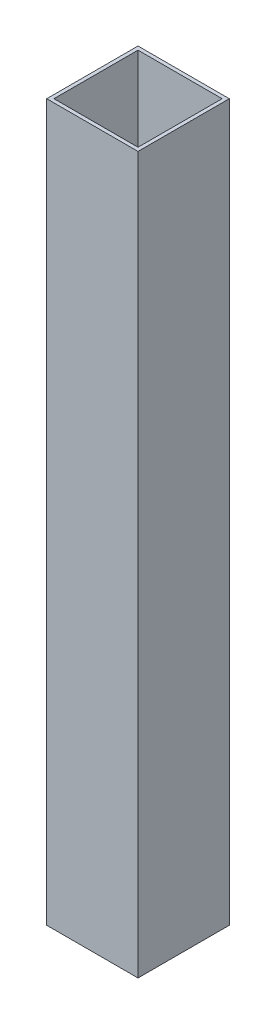
ISO-10303-21;
HEADER;
FILE_DESCRIPTION(('STEP AP214'),'2;1');
FILE_NAME('part.step','',(''),(''),'','','');
FILE_SCHEMA(('AUTOMOTIVE_DESIGN { 1 0 10303 214 1 1 1 1 }'));
ENDSEC;
DATA;
#1=APPLICATION_CONTEXT('core data for automotive mechanical design processes');
#2=APPLICATION_PROTOCOL_DEFINITION('international standard','automotive_design',2000,#1);
#3=PRODUCT_CONTEXT('',#1,'mechanical');
#4=PRODUCT('Part','Part','',(#3));
#5=PRODUCT_RELATED_PRODUCT_CATEGORY('part','',(#4));
#6=PRODUCT_DEFINITION_FORMATION('','',#4);
#7=PRODUCT_DEFINITION_CONTEXT('part definition',#1,'design');
#8=PRODUCT_DEFINITION('design','',#6,#7);
#9=PRODUCT_DEFINITION_SHAPE('','',#8);
#10=(LENGTH_UNIT() NAMED_UNIT(*) SI_UNIT(.MILLI.,.METRE.));
#11=(NAMED_UNIT(*) PLANE_ANGLE_UNIT() SI_UNIT($,.RADIAN.));
#12=(NAMED_UNIT(*) SI_UNIT($,.STERADIAN.) SOLID_ANGLE_UNIT());
#13=UNCERTAINTY_MEASURE_WITH_UNIT(LENGTH_MEASURE(1.E-05),#10,'distance_accuracy_value','');
#14=(GEOMETRIC_REPRESENTATION_CONTEXT(3) GLOBAL_UNCERTAINTY_ASSIGNED_CONTEXT((#13)) GLOBAL_UNIT_ASSIGNED_CONTEXT((#10,
#11,#12)) REPRESENTATION_CONTEXT('',''));
#15=CARTESIAN_POINT('',(0.,0.,0.));
#16=DIRECTION('',(0.,0.,1.));
#17=DIRECTION('',(1.,0.,0.));
#18=AXIS2_PLACEMENT_3D('',#15,#16,#17);
#19=CARTESIAN_POINT('',(0.,199.2,0.));
#20=DIRECTION('',(0.,1.,0.));
#21=DIRECTION('',(0.,0.,1.));
#22=AXIS2_PLACEMENT_3D('',#19,#20,#21);
#23=PLANE('',#22);
#24=DIRECTION('',(0.,0.,1.));
#25=VECTOR('',#24,1.);
#26=CARTESIAN_POINT('',(0.,199.2,0.));
#27=LINE('',#26,#25);
#28=CARTESIAN_POINT('',(0.,199.2,0.));
#29=VERTEX_POINT('',#28);
#30=CARTESIAN_POINT('',(0.,199.2,25.4));
#31=VERTEX_POINT('',#30);
#32=EDGE_CURVE('E140',#29,#31,#27,.T.);
#33=ORIENTED_EDGE('',*,*,#32,.T.);
#34=DIRECTION('',(1.,0.,0.));
#35=VECTOR('',#34,1.);
#36=CARTESIAN_POINT('',(0.,199.2,25.4));
#37=LINE('',#36,#35);
#38=CARTESIAN_POINT('',(25.4,199.2,25.4));
#39=VERTEX_POINT('',#38);
#40=EDGE_CURVE('E143',#31,#39,#37,.T.);
#41=ORIENTED_EDGE('',*,*,#40,.T.);
#42=DIRECTION('',(0.,0.,-1.));
#43=VECTOR('',#42,1.);
#44=CARTESIAN_POINT('',(25.4,199.2,0.));
#45=LINE('',#44,#43);
#46=CARTESIAN_POINT('',(25.4,199.2,0.));
#47=VERTEX_POINT('',#46);
#48=EDGE_CURVE('E146',#39,#47,#45,.T.);
#49=ORIENTED_EDGE('',*,*,#48,.T.);
#50=DIRECTION('',(-1.,0.,0.));
#51=VECTOR('',#50,1.);
#52=CARTESIAN_POINT('',(0.,199.2,0.));
#53=LINE('',#52,#51);
#54=EDGE_CURVE('E148',#47,#29,#53,.T.);
#55=ORIENTED_EDGE('',*,*,#54,.T.);
#56=EDGE_LOOP('',(#33,#41,#49,#55));
#57=FACE_BOUND('',#56,.T.);
#58=DIRECTION('',(1.,0.,0.));
#59=VECTOR('',#58,1.);
#60=CARTESIAN_POINT('',(1.,199.2,24.4));
#61=LINE('',#60,#59);
#62=CARTESIAN_POINT('',(1.,199.2,24.4));
#63=VERTEX_POINT('',#62);
#64=CARTESIAN_POINT('',(24.4,199.2,24.4));
#65=VERTEX_POINT('',#64);
#66=EDGE_CURVE('E112',#63,#65,#61,.T.);
#67=ORIENTED_EDGE('',*,*,#66,.F.);
#68=DIRECTION('',(0.,0.,1.));
#69=VECTOR('',#68,1.);
#70=CARTESIAN_POINT('',(1.,199.2,1.));
#71=LINE('',#70,#69);
#72=CARTESIAN_POINT('',(1.,199.2,1.));
#73=VERTEX_POINT('',#72);
#74=EDGE_CURVE('E104',#73,#63,#71,.T.);
#75=ORIENTED_EDGE('',*,*,#74,.F.);
#76=DIRECTION('',(-1.,0.,0.));
#77=VECTOR('',#76,1.);
#78=CARTESIAN_POINT('',(1.,199.2,1.));
#79=LINE('',#78,#77);
#80=CARTESIAN_POINT('',(24.4,199.2,1.));
#81=VERTEX_POINT('',#80);
#82=EDGE_CURVE('E126',#81,#73,#79,.T.);
#83=ORIENTED_EDGE('',*,*,#82,.F.);
#84=DIRECTION('',(0.,0.,-1.));
#85=VECTOR('',#84,1.);
#86=CARTESIAN_POINT('',(24.4,199.2,1.));
#87=LINE('',#86,#85);
#88=EDGE_CURVE('E124',#65,#81,#87,.T.);
#89=ORIENTED_EDGE('',*,*,#88,.F.);
#90=EDGE_LOOP('',(#67,#75,#83,#89));
#91=FACE_BOUND('',#90,.T.);
#92=ADVANCED_FACE('F39',(#57,#91),#23,.T.);
#93=CARTESIAN_POINT('',(0.,0.,0.));
#94=DIRECTION('',(0.,1.,0.));
#95=DIRECTION('',(0.,0.,1.));
#96=AXIS2_PLACEMENT_3D('',#93,#94,#95);
#97=PLANE('',#96);
#98=DIRECTION('',(0.,0.,1.));
#99=VECTOR('',#98,1.);
#100=CARTESIAN_POINT('',(0.,0.,0.));
#101=LINE('',#100,#99);
#102=CARTESIAN_POINT('',(0.,0.,0.));
#103=VERTEX_POINT('',#102);
#104=CARTESIAN_POINT('',(0.,0.,25.4));
#105=VERTEX_POINT('',#104);
#106=EDGE_CURVE('E120',#103,#105,#101,.T.);
#107=ORIENTED_EDGE('',*,*,#106,.F.);
#108=DIRECTION('',(-1.,0.,0.));
#109=VECTOR('',#108,1.);
#110=CARTESIAN_POINT('',(0.,0.,0.));
#111=LINE('',#110,#109);
#112=CARTESIAN_POINT('',(25.4,0.,0.));
#113=VERTEX_POINT('',#112);
#114=EDGE_CURVE('E144',#113,#103,#111,.T.);
#115=ORIENTED_EDGE('',*,*,#114,.F.);
#116=DIRECTION('',(0.,0.,-1.));
#117=VECTOR('',#116,1.);
#118=CARTESIAN_POINT('',(25.4,0.,0.));
#119=LINE('',#118,#117);
#120=CARTESIAN_POINT('',(25.4,0.,25.4));
#121=VERTEX_POINT('',#120);
#122=EDGE_CURVE('E155',#121,#113,#119,.T.);
#123=ORIENTED_EDGE('',*,*,#122,.F.);
#124=DIRECTION('',(1.,0.,0.));
#125=VECTOR('',#124,1.);
#126=CARTESIAN_POINT('',(0.,0.,25.4));
#127=LINE('',#126,#125);
#128=EDGE_CURVE('E153',#105,#121,#127,.T.);
#129=ORIENTED_EDGE('',*,*,#128,.F.);
#130=EDGE_LOOP('',(#107,#115,#123,#129));
#131=FACE_BOUND('',#130,.T.);
#132=DIRECTION('',(0.,0.,1.));
#133=VECTOR('',#132,1.);
#134=CARTESIAN_POINT('',(1.,0.,1.));
#135=LINE('',#134,#133);
#136=CARTESIAN_POINT('',(1.,0.,1.));
#137=VERTEX_POINT('',#136);
#138=CARTESIAN_POINT('',(1.,0.,24.4));
#139=VERTEX_POINT('',#138);
#140=EDGE_CURVE('E62',#137,#139,#135,.T.);
#141=ORIENTED_EDGE('',*,*,#140,.T.);
#142=DIRECTION('',(1.,0.,0.));
#143=VECTOR('',#142,1.);
#144=CARTESIAN_POINT('',(1.,0.,24.4));
#145=LINE('',#144,#143);
#146=CARTESIAN_POINT('',(24.4,0.,24.4));
#147=VERTEX_POINT('',#146);
#148=EDGE_CURVE('E119',#139,#147,#145,.T.);
#149=ORIENTED_EDGE('',*,*,#148,.T.);
#150=DIRECTION('',(0.,0.,-1.));
#151=VECTOR('',#150,1.);
#152=CARTESIAN_POINT('',(24.4,0.,1.));
#153=LINE('',#152,#151);
#154=CARTESIAN_POINT('',(24.4,0.,1.));
#155=VERTEX_POINT('',#154);
#156=EDGE_CURVE('E132',#147,#155,#153,.T.);
#157=ORIENTED_EDGE('',*,*,#156,.T.);
#158=DIRECTION('',(-1.,0.,0.));
#159=VECTOR('',#158,1.);
#160=CARTESIAN_POINT('',(1.,0.,1.));
#161=LINE('',#160,#159);
#162=EDGE_CURVE('E113',#155,#137,#161,.T.);
#163=ORIENTED_EDGE('',*,*,#162,.T.);
#164=EDGE_LOOP('',(#141,#149,#157,#163));
#165=FACE_BOUND('',#164,.T.);
#166=ADVANCED_FACE('F173',(#131,#165),#97,.F.);
#167=CARTESIAN_POINT('',(0.,199.2,0.));
#168=DIRECTION('',(1.,0.,0.));
#169=DIRECTION('',(0.,0.,-1.));
#170=AXIS2_PLACEMENT_3D('',#167,#168,#169);
#171=PLANE('',#170);
#172=ORIENTED_EDGE('',*,*,#106,.T.);
#173=DIRECTION('',(0.,-1.,0.));
#174=VECTOR('',#173,1.);
#175=CARTESIAN_POINT('',(0.,199.2,25.4));
#176=LINE('',#175,#174);
#177=EDGE_CURVE('E11',#31,#105,#176,.T.);
#178=ORIENTED_EDGE('',*,*,#177,.F.);
#179=ORIENTED_EDGE('',*,*,#32,.F.);
#180=DIRECTION('',(0.,-1.,0.));
#181=VECTOR('',#180,1.);
#182=CARTESIAN_POINT('',(0.,199.2,0.));
#183=LINE('',#182,#181);
#184=EDGE_CURVE('E150',#29,#103,#183,.T.);
#185=ORIENTED_EDGE('',*,*,#184,.T.);
#186=EDGE_LOOP('',(#172,#178,#179,#185));
#187=FACE_BOUND('',#186,.T.);
#188=ADVANCED_FACE('F41',(#187),#171,.F.);
#189=CARTESIAN_POINT('',(0.,199.2,25.4));
#190=DIRECTION('',(0.,0.,-1.));
#191=DIRECTION('',(-1.,0.,0.));
#192=AXIS2_PLACEMENT_3D('',#189,#190,#191);
#193=PLANE('',#192);
#194=ORIENTED_EDGE('',*,*,#128,.T.);
#195=DIRECTION('',(0.,-1.,0.));
#196=VECTOR('',#195,1.);
#197=CARTESIAN_POINT('',(25.4,199.2,25.4));
#198=LINE('',#197,#196);
#199=EDGE_CURVE('E47',#39,#121,#198,.T.);
#200=ORIENTED_EDGE('',*,*,#199,.F.);
#201=ORIENTED_EDGE('',*,*,#40,.F.);
#202=ORIENTED_EDGE('',*,*,#177,.T.);
#203=EDGE_LOOP('',(#194,#200,#201,#202));
#204=FACE_BOUND('',#203,.T.);
#205=ADVANCED_FACE('F183',(#204),#193,.F.);
#206=CARTESIAN_POINT('',(25.4,199.2,0.));
#207=DIRECTION('',(-1.,0.,0.));
#208=DIRECTION('',(0.,0.,1.));
#209=AXIS2_PLACEMENT_3D('',#206,#207,#208);
#210=PLANE('',#209);
#211=ORIENTED_EDGE('',*,*,#122,.T.);
#212=DIRECTION('',(0.,-1.,0.));
#213=VECTOR('',#212,1.);
#214=CARTESIAN_POINT('',(25.4,199.2,0.));
#215=LINE('',#214,#213);
#216=EDGE_CURVE('E160',#47,#113,#215,.T.);
#217=ORIENTED_EDGE('',*,*,#216,.F.);
#218=ORIENTED_EDGE('',*,*,#48,.F.);
#219=ORIENTED_EDGE('',*,*,#199,.T.);
#220=EDGE_LOOP('',(#211,#217,#218,#219));
#221=FACE_BOUND('',#220,.T.);
#222=ADVANCED_FACE('F167',(#221),#210,.F.);
#223=CARTESIAN_POINT('',(0.,199.2,0.));
#224=DIRECTION('',(0.,0.,1.));
#225=DIRECTION('',(1.,0.,0.));
#226=AXIS2_PLACEMENT_3D('',#223,#224,#225);
#227=PLANE('',#226);
#228=ORIENTED_EDGE('',*,*,#114,.T.);
#229=ORIENTED_EDGE('',*,*,#184,.F.);
#230=ORIENTED_EDGE('',*,*,#54,.F.);
#231=ORIENTED_EDGE('',*,*,#216,.T.);
#232=EDGE_LOOP('',(#228,#229,#230,#231));
#233=FACE_BOUND('',#232,.T.);
#234=ADVANCED_FACE('F177',(#233),#227,.F.);
#235=CARTESIAN_POINT('',(1.,199.2,1.));
#236=DIRECTION('',(1.,0.,0.));
#237=DIRECTION('',(0.,0.,-1.));
#238=AXIS2_PLACEMENT_3D('',#235,#236,#237);
#239=PLANE('',#238);
#240=ORIENTED_EDGE('',*,*,#140,.F.);
#241=DIRECTION('',(0.,-1.,0.));
#242=VECTOR('',#241,1.);
#243=CARTESIAN_POINT('',(1.,199.2,1.));
#244=LINE('',#243,#242);
#245=EDGE_CURVE('E108',#73,#137,#244,.T.);
#246=ORIENTED_EDGE('',*,*,#245,.F.);
#247=ORIENTED_EDGE('',*,*,#74,.T.);
#248=DIRECTION('',(0.,-1.,0.));
#249=VECTOR('',#248,1.);
#250=CARTESIAN_POINT('',(1.,199.2,24.4));
#251=LINE('',#250,#249);
#252=EDGE_CURVE('E107',#63,#139,#251,.T.);
#253=ORIENTED_EDGE('',*,*,#252,.T.);
#254=EDGE_LOOP('',(#240,#246,#247,#253));
#255=FACE_BOUND('',#254,.T.);
#256=ADVANCED_FACE('F106',(#255),#239,.T.);
#257=CARTESIAN_POINT('',(1.,199.2,24.4));
#258=DIRECTION('',(0.,0.,-1.));
#259=DIRECTION('',(-1.,0.,0.));
#260=AXIS2_PLACEMENT_3D('',#257,#258,#259);
#261=PLANE('',#260);
#262=ORIENTED_EDGE('',*,*,#148,.F.);
#263=ORIENTED_EDGE('',*,*,#252,.F.);
#264=ORIENTED_EDGE('',*,*,#66,.T.);
#265=DIRECTION('',(0.,-1.,0.));
#266=VECTOR('',#265,1.);
#267=CARTESIAN_POINT('',(24.4,199.2,24.4));
#268=LINE('',#267,#266);
#269=EDGE_CURVE('E121',#65,#147,#268,.T.);
#270=ORIENTED_EDGE('',*,*,#269,.T.);
#271=EDGE_LOOP('',(#262,#263,#264,#270));
#272=FACE_BOUND('',#271,.T.);
#273=ADVANCED_FACE('F116',(#272),#261,.T.);
#274=CARTESIAN_POINT('',(24.4,199.2,1.));
#275=DIRECTION('',(-1.,0.,0.));
#276=DIRECTION('',(0.,0.,1.));
#277=AXIS2_PLACEMENT_3D('',#274,#275,#276);
#278=PLANE('',#277);
#279=ORIENTED_EDGE('',*,*,#156,.F.);
#280=ORIENTED_EDGE('',*,*,#269,.F.);
#281=ORIENTED_EDGE('',*,*,#88,.T.);
#282=DIRECTION('',(0.,-1.,0.));
#283=VECTOR('',#282,1.);
#284=CARTESIAN_POINT('',(24.4,199.2,1.));
#285=LINE('',#284,#283);
#286=EDGE_CURVE('E54',#81,#155,#285,.T.);
#287=ORIENTED_EDGE('',*,*,#286,.T.);
#288=EDGE_LOOP('',(#279,#280,#281,#287));
#289=FACE_BOUND('',#288,.T.);
#290=ADVANCED_FACE('F206',(#289),#278,.T.);
#291=CARTESIAN_POINT('',(1.,199.2,1.));
#292=DIRECTION('',(0.,0.,1.));
#293=DIRECTION('',(1.,0.,0.));
#294=AXIS2_PLACEMENT_3D('',#291,#292,#293);
#295=PLANE('',#294);
#296=ORIENTED_EDGE('',*,*,#162,.F.);
#297=ORIENTED_EDGE('',*,*,#286,.F.);
#298=ORIENTED_EDGE('',*,*,#82,.T.);
#299=ORIENTED_EDGE('',*,*,#245,.T.);
#300=EDGE_LOOP('',(#296,#297,#298,#299));
#301=FACE_BOUND('',#300,.T.);
#302=ADVANCED_FACE('F210',(#301),#295,.T.);
#303=CLOSED_SHELL('',(#92,#166,#188,#205,#222,#234,#256,#273,#290,#302));
#304=MANIFOLD_SOLID_BREP('B2',#303);
#305=ADVANCED_BREP_SHAPE_REPRESENTATION('',(#18,#304),#14);
#306=SHAPE_DEFINITION_REPRESENTATION(#9,#305);
ENDSEC;
END-ISO-10303-21;
